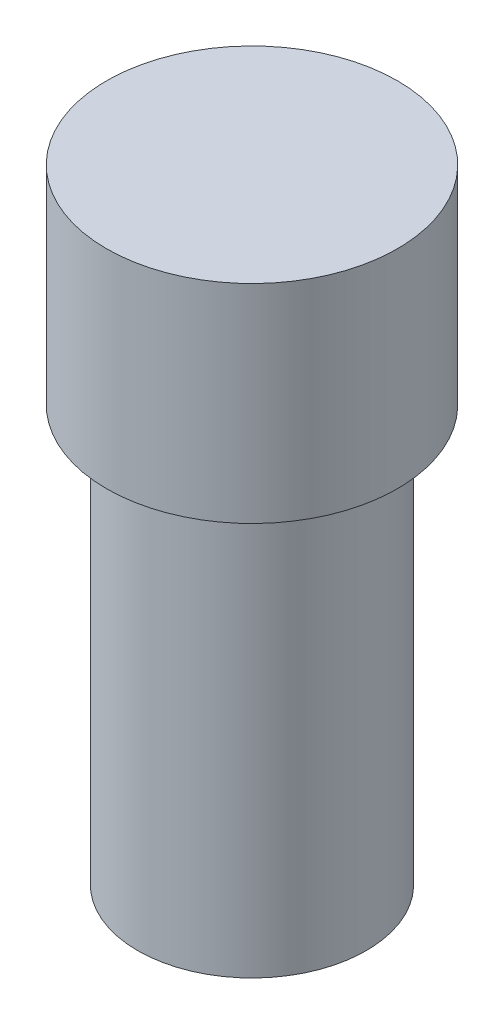
ISO-10303-21;
HEADER;
FILE_DESCRIPTION(('STEP AP214'),'2;1');
FILE_NAME('part.step','',(''),(''),'','','');
FILE_SCHEMA(('AUTOMOTIVE_DESIGN { 1 0 10303 214 1 1 1 1 }'));
ENDSEC;
DATA;
#1=APPLICATION_CONTEXT('core data for automotive mechanical design processes');
#2=APPLICATION_PROTOCOL_DEFINITION('international standard','automotive_design',2000,#1);
#3=PRODUCT_CONTEXT('',#1,'mechanical');
#4=PRODUCT('Part','Part','',(#3));
#5=PRODUCT_RELATED_PRODUCT_CATEGORY('part','',(#4));
#6=PRODUCT_DEFINITION_FORMATION('','',#4);
#7=PRODUCT_DEFINITION_CONTEXT('part definition',#1,'design');
#8=PRODUCT_DEFINITION('design','',#6,#7);
#9=PRODUCT_DEFINITION_SHAPE('','',#8);
#10=(LENGTH_UNIT() NAMED_UNIT(*) SI_UNIT(.MILLI.,.METRE.));
#11=(NAMED_UNIT(*) PLANE_ANGLE_UNIT() SI_UNIT($,.RADIAN.));
#12=(NAMED_UNIT(*) SI_UNIT($,.STERADIAN.) SOLID_ANGLE_UNIT());
#13=UNCERTAINTY_MEASURE_WITH_UNIT(LENGTH_MEASURE(1.E-05),#10,'distance_accuracy_value','');
#14=(GEOMETRIC_REPRESENTATION_CONTEXT(3) GLOBAL_UNCERTAINTY_ASSIGNED_CONTEXT((#13)) GLOBAL_UNIT_ASSIGNED_CONTEXT((#10,
#11,#12)) REPRESENTATION_CONTEXT('',''));
#15=CARTESIAN_POINT('',(0.,0.,0.));
#16=DIRECTION('',(0.,0.,1.));
#17=DIRECTION('',(1.,0.,0.));
#18=AXIS2_PLACEMENT_3D('',#15,#16,#17);
#19=CARTESIAN_POINT('',(0.,10.,0.));
#20=DIRECTION('',(0.,-1.,0.));
#21=DIRECTION('',(0.,0.,-1.));
#22=AXIS2_PLACEMENT_3D('',#19,#20,#21);
#23=CYLINDRICAL_SURFACE('',#22,2.75);
#24=CARTESIAN_POINT('',(0.,10.,0.));
#25=DIRECTION('',(0.,1.,0.));
#26=DIRECTION('',(0.,0.,1.));
#27=AXIS2_PLACEMENT_3D('',#24,#25,#26);
#28=CIRCLE('',#27,2.75);
#29=CARTESIAN_POINT('',(0.,10.,2.75));
#30=VERTEX_POINT('',#29);
#31=EDGE_CURVE('E10',#30,#30,#28,.T.);
#32=ORIENTED_EDGE('',*,*,#31,.F.);
#33=EDGE_LOOP('',(#32));
#34=FACE_BOUND('',#33,.T.);
#35=CARTESIAN_POINT('',(0.,0.,0.));
#36=DIRECTION('',(0.,1.,0.));
#37=DIRECTION('',(0.,0.,1.));
#38=AXIS2_PLACEMENT_3D('',#35,#36,#37);
#39=CIRCLE('',#38,2.75);
#40=CARTESIAN_POINT('',(0.,0.,2.75));
#41=VERTEX_POINT('',#40);
#42=EDGE_CURVE('E34',#41,#41,#39,.T.);
#43=ORIENTED_EDGE('',*,*,#42,.T.);
#44=EDGE_LOOP('',(#43));
#45=FACE_BOUND('',#44,.T.);
#46=ADVANCED_FACE('F31',(#34,#45),#23,.T.);
#47=CARTESIAN_POINT('',(0.,0.,0.));
#48=DIRECTION('',(0.,1.,0.));
#49=DIRECTION('',(0.,0.,1.));
#50=AXIS2_PLACEMENT_3D('',#47,#48,#49);
#51=PLANE('',#50);
#52=ORIENTED_EDGE('',*,*,#42,.F.);
#53=EDGE_LOOP('',(#52));
#54=FACE_BOUND('',#53,.T.);
#55=ADVANCED_FACE('F54',(#54),#51,.F.);
#56=CARTESIAN_POINT('',(0.,15.,0.));
#57=DIRECTION('',(0.,-1.,0.));
#58=DIRECTION('',(0.,0.,-1.));
#59=AXIS2_PLACEMENT_3D('',#56,#57,#58);
#60=CYLINDRICAL_SURFACE('',#59,3.5);
#61=CARTESIAN_POINT('',(0.,15.,0.));
#62=DIRECTION('',(0.,1.,0.));
#63=DIRECTION('',(0.,0.,1.));
#64=AXIS2_PLACEMENT_3D('',#61,#62,#63);
#65=CIRCLE('',#64,3.5);
#66=CARTESIAN_POINT('',(0.,15.,3.5));
#67=VERTEX_POINT('',#66);
#68=EDGE_CURVE('E41',#67,#67,#65,.T.);
#69=ORIENTED_EDGE('',*,*,#68,.F.);
#70=EDGE_LOOP('',(#69));
#71=FACE_BOUND('',#70,.T.);
#72=CARTESIAN_POINT('',(0.,10.,0.));
#73=DIRECTION('',(0.,1.,0.));
#74=DIRECTION('',(0.,0.,1.));
#75=AXIS2_PLACEMENT_3D('',#72,#73,#74);
#76=CIRCLE('',#75,3.5);
#77=CARTESIAN_POINT('',(0.,10.,3.5));
#78=VERTEX_POINT('',#77);
#79=EDGE_CURVE('E43',#78,#78,#76,.T.);
#80=ORIENTED_EDGE('',*,*,#79,.T.);
#81=EDGE_LOOP('',(#80));
#82=FACE_BOUND('',#81,.T.);
#83=ADVANCED_FACE('F51',(#71,#82),#60,.T.);
#84=CARTESIAN_POINT('',(0.,15.,0.));
#85=DIRECTION('',(0.,1.,0.));
#86=DIRECTION('',(0.,0.,1.));
#87=AXIS2_PLACEMENT_3D('',#84,#85,#86);
#88=PLANE('',#87);
#89=ORIENTED_EDGE('',*,*,#68,.T.);
#90=EDGE_LOOP('',(#89));
#91=FACE_BOUND('',#90,.T.);
#92=ADVANCED_FACE('F49',(#91),#88,.T.);
#93=CARTESIAN_POINT('',(0.,10.,0.));
#94=DIRECTION('',(0.,1.,0.));
#95=DIRECTION('',(0.,0.,1.));
#96=AXIS2_PLACEMENT_3D('',#93,#94,#95);
#97=PLANE('',#96);
#98=ORIENTED_EDGE('',*,*,#31,.T.);
#99=EDGE_LOOP('',(#98));
#100=FACE_BOUND('',#99,.T.);
#101=ORIENTED_EDGE('',*,*,#79,.F.);
#102=EDGE_LOOP('',(#101));
#103=FACE_BOUND('',#102,.T.);
#104=ADVANCED_FACE('F58',(#100,#103),#97,.F.);
#105=CLOSED_SHELL('',(#46,#55,#83,#92,#104));
#106=MANIFOLD_SOLID_BREP('B2',#105);
#107=ADVANCED_BREP_SHAPE_REPRESENTATION('',(#18,#106),#14);
#108=SHAPE_DEFINITION_REPRESENTATION(#9,#107);
ENDSEC;
END-ISO-10303-21;
